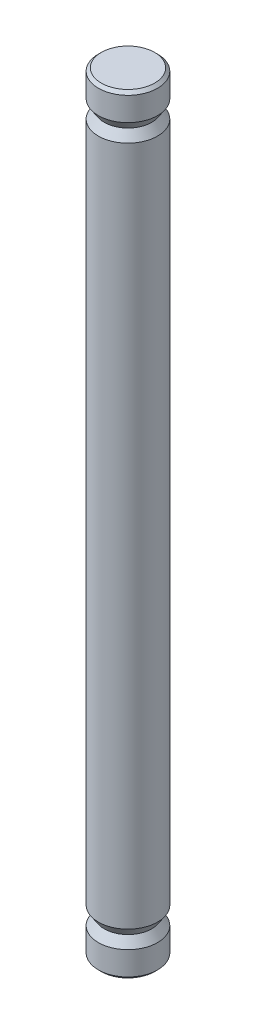
ISO-10303-21;
HEADER;
FILE_DESCRIPTION(('STEP AP214'),'2;1');
FILE_NAME('part.step','',(''),(''),'','','');
FILE_SCHEMA(('AUTOMOTIVE_DESIGN { 1 0 10303 214 1 1 1 1 }'));
ENDSEC;
DATA;
#1=APPLICATION_CONTEXT('core data for automotive mechanical design processes');
#2=APPLICATION_PROTOCOL_DEFINITION('international standard','automotive_design',2000,#1);
#3=PRODUCT_CONTEXT('',#1,'mechanical');
#4=PRODUCT('Part','Part','',(#3));
#5=PRODUCT_RELATED_PRODUCT_CATEGORY('part','',(#4));
#6=PRODUCT_DEFINITION_FORMATION('','',#4);
#7=PRODUCT_DEFINITION_CONTEXT('part definition',#1,'design');
#8=PRODUCT_DEFINITION('design','',#6,#7);
#9=PRODUCT_DEFINITION_SHAPE('','',#8);
#10=(LENGTH_UNIT() NAMED_UNIT(*) SI_UNIT(.MILLI.,.METRE.));
#11=(NAMED_UNIT(*) PLANE_ANGLE_UNIT() SI_UNIT($,.RADIAN.));
#12=(NAMED_UNIT(*) SI_UNIT($,.STERADIAN.) SOLID_ANGLE_UNIT());
#13=UNCERTAINTY_MEASURE_WITH_UNIT(LENGTH_MEASURE(1.E-05),#10,'distance_accuracy_value','');
#14=(GEOMETRIC_REPRESENTATION_CONTEXT(3) GLOBAL_UNCERTAINTY_ASSIGNED_CONTEXT((#13)) GLOBAL_UNIT_ASSIGNED_CONTEXT((#10,
#11,#12)) REPRESENTATION_CONTEXT('',''));
#15=CARTESIAN_POINT('',(0.,0.,0.));
#16=DIRECTION('',(0.,0.,1.));
#17=DIRECTION('',(1.,0.,0.));
#18=AXIS2_PLACEMENT_3D('',#15,#16,#17);
#19=CARTESIAN_POINT('',(0.,65.,0.));
#20=DIRECTION('',(0.,-1.,0.));
#21=DIRECTION('',(0.,0.,-1.));
#22=AXIS2_PLACEMENT_3D('',#19,#20,#21);
#23=CYLINDRICAL_SURFACE('',#22,2.5);
#24=CARTESIAN_POINT('',(0.,64.75,0.));
#25=DIRECTION('',(0.,1.,0.));
#26=DIRECTION('',(0.,0.,1.));
#27=AXIS2_PLACEMENT_3D('',#24,#25,#26);
#28=CIRCLE('',#27,2.5);
#29=CARTESIAN_POINT('',(0.,64.75,2.5));
#30=VERTEX_POINT('',#29);
#31=EDGE_CURVE('E55',#30,#30,#28,.F.);
#32=ORIENTED_EDGE('',*,*,#31,.T.);
#33=EDGE_LOOP('',(#32));
#34=FACE_BOUND('',#33,.T.);
#35=CARTESIAN_POINT('',(0.,62.75,0.));
#36=DIRECTION('',(0.,1.,0.));
#37=DIRECTION('',(0.,0.,1.));
#38=AXIS2_PLACEMENT_3D('',#35,#36,#37);
#39=CIRCLE('',#38,2.5);
#40=CARTESIAN_POINT('',(0.,62.75,2.5));
#41=VERTEX_POINT('',#40);
#42=EDGE_CURVE('E60',#41,#41,#39,.T.);
#43=ORIENTED_EDGE('',*,*,#42,.T.);
#44=EDGE_LOOP('',(#43));
#45=FACE_BOUND('',#44,.T.);
#46=ADVANCED_FACE('F39',(#34,#45),#23,.T.);
#47=CARTESIAN_POINT('',(0.,65.,0.));
#48=DIRECTION('',(0.,1.,0.));
#49=DIRECTION('',(0.,0.,1.));
#50=AXIS2_PLACEMENT_3D('',#47,#48,#49);
#51=PLANE('',#50);
#52=CARTESIAN_POINT('',(0.,65.,0.));
#53=DIRECTION('',(0.,1.,0.));
#54=DIRECTION('',(0.,0.,1.));
#55=AXIS2_PLACEMENT_3D('',#52,#53,#54);
#56=CIRCLE('',#55,2.25000000000002);
#57=CARTESIAN_POINT('',(0.,65.,2.25000000000002));
#58=VERTEX_POINT('',#57);
#59=EDGE_CURVE('E10',#58,#58,#56,.T.);
#60=ORIENTED_EDGE('',*,*,#59,.T.);
#61=EDGE_LOOP('',(#60));
#62=FACE_BOUND('',#61,.T.);
#63=ADVANCED_FACE('F102',(#62),#51,.T.);
#64=CARTESIAN_POINT('',(0.,65.,0.));
#65=DIRECTION('',(0.,-1.,0.));
#66=DIRECTION('',(0.,0.,-1.));
#67=AXIS2_PLACEMENT_3D('',#64,#65,#66);
#68=CONICAL_SURFACE('',#67,2.25000000000002,0.785398163397458);
#69=ORIENTED_EDGE('',*,*,#31,.F.);
#70=EDGE_LOOP('',(#69));
#71=FACE_BOUND('',#70,.T.);
#72=ORIENTED_EDGE('',*,*,#59,.F.);
#73=EDGE_LOOP('',(#72));
#74=FACE_BOUND('',#73,.T.);
#75=ADVANCED_FACE('F42',(#71,#74),#68,.T.);
#76=CARTESIAN_POINT('',(0.,62.75,0.));
#77=DIRECTION('',(0.,1.,0.));
#78=DIRECTION('',(0.,0.,1.));
#79=AXIS2_PLACEMENT_3D('',#76,#77,#78);
#80=CONICAL_SURFACE('',#79,2.5,0.588002603547567);
#81=CARTESIAN_POINT('',(0.,62.,0.));
#82=DIRECTION('',(0.,1.,0.));
#83=DIRECTION('',(0.,0.,1.));
#84=AXIS2_PLACEMENT_3D('',#81,#82,#83);
#85=CIRCLE('',#84,2.);
#86=CARTESIAN_POINT('',(0.,62.,2.));
#87=VERTEX_POINT('',#86);
#88=EDGE_CURVE('E73',#87,#87,#85,.T.);
#89=ORIENTED_EDGE('',*,*,#88,.T.);
#90=EDGE_LOOP('',(#89));
#91=FACE_BOUND('',#90,.T.);
#92=ORIENTED_EDGE('',*,*,#42,.F.);
#93=EDGE_LOOP('',(#92));
#94=FACE_BOUND('',#93,.T.);
#95=ADVANCED_FACE('F95',(#91,#94),#80,.T.);
#96=CARTESIAN_POINT('',(0.,62.,0.));
#97=DIRECTION('',(0.,-1.,0.));
#98=DIRECTION('',(0.,0.,-1.));
#99=AXIS2_PLACEMENT_3D('',#96,#97,#98);
#100=CONICAL_SURFACE('',#99,2.,0.588002603547567);
#101=CARTESIAN_POINT('',(0.,61.25,0.));
#102=DIRECTION('',(0.,1.,0.));
#103=DIRECTION('',(0.,0.,1.));
#104=AXIS2_PLACEMENT_3D('',#101,#102,#103);
#105=CIRCLE('',#104,2.5);
#106=CARTESIAN_POINT('',(0.,61.25,2.5));
#107=VERTEX_POINT('',#106);
#108=EDGE_CURVE('E64',#107,#107,#105,.T.);
#109=ORIENTED_EDGE('',*,*,#108,.T.);
#110=EDGE_LOOP('',(#109));
#111=FACE_BOUND('',#110,.T.);
#112=ORIENTED_EDGE('',*,*,#88,.F.);
#113=EDGE_LOOP('',(#112));
#114=FACE_BOUND('',#113,.T.);
#115=ADVANCED_FACE('F79',(#111,#114),#100,.T.);
#116=CARTESIAN_POINT('',(0.,3.75000000000003,0.));
#117=DIRECTION('',(0.,1.,0.));
#118=DIRECTION('',(0.,0.,1.));
#119=AXIS2_PLACEMENT_3D('',#116,#117,#118);
#120=CIRCLE('',#119,2.50000000000001);
#121=CARTESIAN_POINT('',(0.,3.75000000000003,2.50000000000001));
#122=VERTEX_POINT('',#121);
#123=EDGE_CURVE('E65',#122,#122,#120,.T.);
#124=ORIENTED_EDGE('',*,*,#123,.T.);
#125=EDGE_LOOP('',(#124));
#126=FACE_BOUND('',#125,.T.);
#127=ORIENTED_EDGE('',*,*,#108,.F.);
#128=EDGE_LOOP('',(#127));
#129=FACE_BOUND('',#128,.T.);
#130=ADVANCED_FACE('F82',(#126,#129),#23,.T.);
#131=CARTESIAN_POINT('',(0.,3.00000000000003,0.));
#132=DIRECTION('',(0.,-1.,0.));
#133=DIRECTION('',(0.,0.,-1.));
#134=AXIS2_PLACEMENT_3D('',#131,#132,#133);
#135=CONICAL_SURFACE('',#134,2.00000000000001,0.588002603547567);
#136=CARTESIAN_POINT('',(0.,2.25000000000003,0.));
#137=DIRECTION('',(0.,1.,0.));
#138=DIRECTION('',(0.,0.,1.));
#139=AXIS2_PLACEMENT_3D('',#136,#137,#138);
#140=CIRCLE('',#139,2.50000000000001);
#141=CARTESIAN_POINT('',(0.,2.25000000000003,2.50000000000001));
#142=VERTEX_POINT('',#141);
#143=EDGE_CURVE('E68',#142,#142,#140,.T.);
#144=ORIENTED_EDGE('',*,*,#143,.T.);
#145=EDGE_LOOP('',(#144));
#146=FACE_BOUND('',#145,.T.);
#147=CARTESIAN_POINT('',(0.,3.00000000000003,0.));
#148=DIRECTION('',(0.,1.,0.));
#149=DIRECTION('',(0.,0.,1.));
#150=AXIS2_PLACEMENT_3D('',#147,#148,#149);
#151=CIRCLE('',#150,2.00000000000001);
#152=CARTESIAN_POINT('',(0.,3.00000000000003,2.00000000000001));
#153=VERTEX_POINT('',#152);
#154=EDGE_CURVE('E61',#153,#153,#151,.T.);
#155=ORIENTED_EDGE('',*,*,#154,.F.);
#156=EDGE_LOOP('',(#155));
#157=FACE_BOUND('',#156,.T.);
#158=ADVANCED_FACE('F84',(#146,#157),#135,.T.);
#159=CARTESIAN_POINT('',(0.,3.75000000000003,0.));
#160=DIRECTION('',(0.,1.,0.));
#161=DIRECTION('',(0.,0.,1.));
#162=AXIS2_PLACEMENT_3D('',#159,#160,#161);
#163=CONICAL_SURFACE('',#162,2.50000000000001,0.588002603547567);
#164=ORIENTED_EDGE('',*,*,#154,.T.);
#165=EDGE_LOOP('',(#164));
#166=FACE_BOUND('',#165,.T.);
#167=ORIENTED_EDGE('',*,*,#123,.F.);
#168=EDGE_LOOP('',(#167));
#169=FACE_BOUND('',#168,.T.);
#170=ADVANCED_FACE('F92',(#166,#169),#163,.T.);
#171=CARTESIAN_POINT('',(0.,0.,0.));
#172=DIRECTION('',(0.,1.,0.));
#173=DIRECTION('',(0.,0.,1.));
#174=AXIS2_PLACEMENT_3D('',#171,#172,#173);
#175=PLANE('',#174);
#176=CARTESIAN_POINT('',(0.,0.,0.));
#177=DIRECTION('',(0.,1.,0.));
#178=DIRECTION('',(0.,0.,1.));
#179=AXIS2_PLACEMENT_3D('',#176,#177,#178);
#180=CIRCLE('',#179,2.25000000000001);
#181=CARTESIAN_POINT('',(0.,0.,2.25000000000001));
#182=VERTEX_POINT('',#181);
#183=EDGE_CURVE('E47',#182,#182,#180,.F.);
#184=ORIENTED_EDGE('',*,*,#183,.T.);
#185=EDGE_LOOP('',(#184));
#186=FACE_BOUND('',#185,.T.);
#187=ADVANCED_FACE('F121',(#186),#175,.F.);
#188=CARTESIAN_POINT('',(0.,0.249999999999986,0.));
#189=DIRECTION('',(0.,1.,0.));
#190=DIRECTION('',(0.,0.,1.));
#191=AXIS2_PLACEMENT_3D('',#188,#189,#190);
#192=CONICAL_SURFACE('',#191,2.5,0.785398163397458);
#193=ORIENTED_EDGE('',*,*,#183,.F.);
#194=EDGE_LOOP('',(#193));
#195=FACE_BOUND('',#194,.T.);
#196=CARTESIAN_POINT('',(0.,0.249999999999986,0.));
#197=DIRECTION('',(0.,1.,0.));
#198=DIRECTION('',(0.,0.,1.));
#199=AXIS2_PLACEMENT_3D('',#196,#197,#198);
#200=CIRCLE('',#199,2.5);
#201=CARTESIAN_POINT('',(0.,0.249999999999986,2.5));
#202=VERTEX_POINT('',#201);
#203=EDGE_CURVE('E51',#202,#202,#200,.T.);
#204=ORIENTED_EDGE('',*,*,#203,.F.);
#205=EDGE_LOOP('',(#204));
#206=FACE_BOUND('',#205,.T.);
#207=ADVANCED_FACE('F99',(#195,#206),#192,.T.);
#208=ORIENTED_EDGE('',*,*,#203,.T.);
#209=EDGE_LOOP('',(#208));
#210=FACE_BOUND('',#209,.T.);
#211=ORIENTED_EDGE('',*,*,#143,.F.);
#212=EDGE_LOOP('',(#211));
#213=FACE_BOUND('',#212,.T.);
#214=ADVANCED_FACE('F87',(#210,#213),#23,.T.);
#215=CLOSED_SHELL('',(#46,#63,#75,#95,#115,#130,#158,#170,#187,#207,#214));
#216=MANIFOLD_SOLID_BREP('B2',#215);
#217=ADVANCED_BREP_SHAPE_REPRESENTATION('',(#18,#216),#14);
#218=SHAPE_DEFINITION_REPRESENTATION(#9,#217);
ENDSEC;
END-ISO-10303-21;
